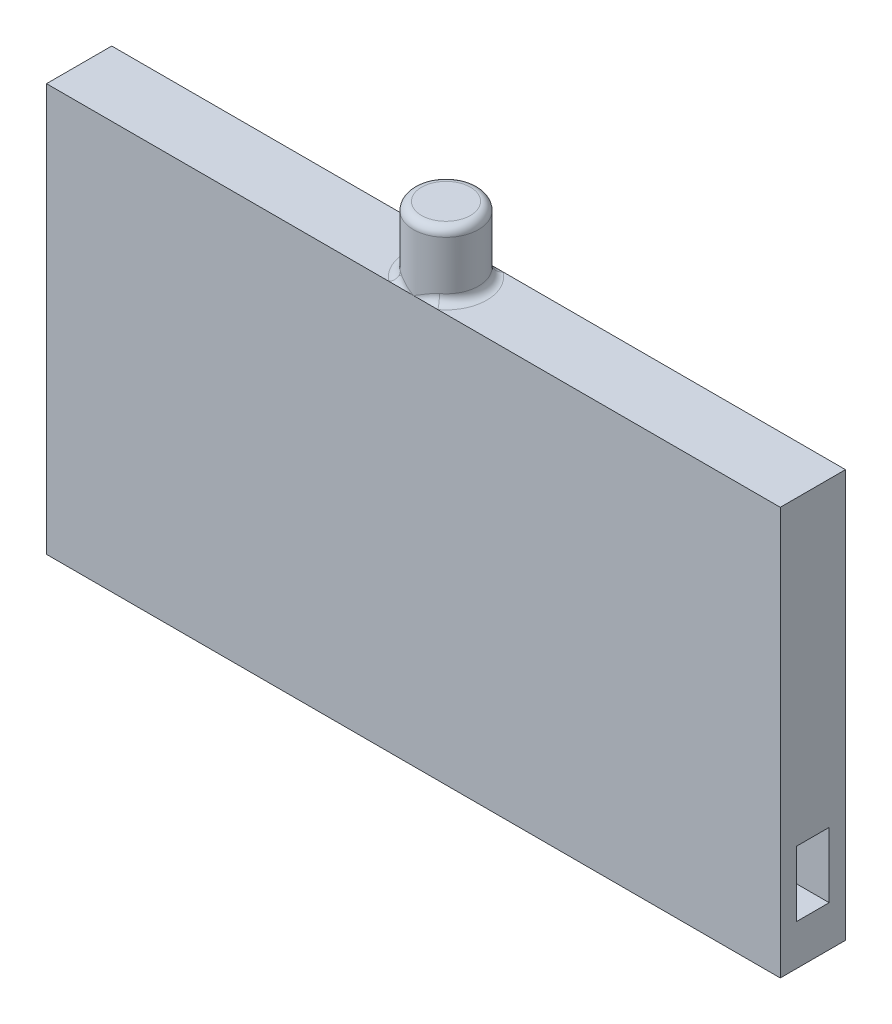
ISO-10303-21;
HEADER;
FILE_DESCRIPTION(('STEP AP214'),'2;1');
FILE_NAME('part.step','',(''),(''),'','','');
FILE_SCHEMA(('AUTOMOTIVE_DESIGN { 1 0 10303 214 1 1 1 1 }'));
ENDSEC;
DATA;
#1=APPLICATION_CONTEXT('core data for automotive mechanical design processes');
#2=APPLICATION_PROTOCOL_DEFINITION('international standard','automotive_design',2000,#1);
#3=PRODUCT_CONTEXT('',#1,'mechanical');
#4=PRODUCT('Part','Part','',(#3));
#5=PRODUCT_RELATED_PRODUCT_CATEGORY('part','',(#4));
#6=PRODUCT_DEFINITION_FORMATION('','',#4);
#7=PRODUCT_DEFINITION_CONTEXT('part definition',#1,'design');
#8=PRODUCT_DEFINITION('design','',#6,#7);
#9=PRODUCT_DEFINITION_SHAPE('','',#8);
#10=(LENGTH_UNIT() NAMED_UNIT(*) SI_UNIT(.MILLI.,.METRE.));
#11=(NAMED_UNIT(*) PLANE_ANGLE_UNIT() SI_UNIT($,.RADIAN.));
#12=(NAMED_UNIT(*) SI_UNIT($,.STERADIAN.) SOLID_ANGLE_UNIT());
#13=UNCERTAINTY_MEASURE_WITH_UNIT(LENGTH_MEASURE(1.E-05),#10,'distance_accuracy_value','');
#14=(GEOMETRIC_REPRESENTATION_CONTEXT(3) GLOBAL_UNCERTAINTY_ASSIGNED_CONTEXT((#13)) GLOBAL_UNIT_ASSIGNED_CONTEXT((#10,
#11,#12)) REPRESENTATION_CONTEXT('',''));
#15=CARTESIAN_POINT('',(0.,0.,0.));
#16=DIRECTION('',(0.,0.,1.));
#17=DIRECTION('',(1.,0.,0.));
#18=AXIS2_PLACEMENT_3D('',#15,#16,#17);
#19=CARTESIAN_POINT('',(0.,12.7,0.));
#20=DIRECTION('',(0.,-1.,0.));
#21=DIRECTION('',(0.,0.,-1.));
#22=AXIS2_PLACEMENT_3D('',#19,#20,#21);
#23=PLANE('',#22);
#24=DIRECTION('',(-1.,0.,0.));
#25=VECTOR('',#24,1.);
#26=CARTESIAN_POINT('',(-9.906,12.7,-15.7398333107177));
#27=LINE('',#26,#25);
#28=CARTESIAN_POINT('',(12.954,12.7,-15.7398333107177));
#29=VERTEX_POINT('',#28);
#30=CARTESIAN_POINT('',(2.286,12.7,-15.7398333107177));
#31=VERTEX_POINT('',#30);
#32=EDGE_CURVE('E211',#29,#31,#27,.T.);
#33=ORIENTED_EDGE('',*,*,#32,.T.);
#34=CARTESIAN_POINT('',(1.524,12.7,-14.7238333107177));
#35=DIRECTION('',(0.,-1.,0.));
#36=DIRECTION('',(0.,0.,-1.));
#37=AXIS2_PLACEMENT_3D('',#34,#35,#36);
#38=CIRCLE('',#37,1.27);
#39=CARTESIAN_POINT('',(2.286,12.7,-13.7078333107177));
#40=VERTEX_POINT('',#39);
#41=EDGE_CURVE('E11',#31,#40,#38,.T.);
#42=ORIENTED_EDGE('',*,*,#41,.T.);
#43=DIRECTION('',(1.,0.,0.));
#44=VECTOR('',#43,1.);
#45=CARTESIAN_POINT('',(-9.906,12.7,-13.7078333107177));
#46=LINE('',#45,#44);
#47=CARTESIAN_POINT('',(12.954,12.7,-13.7078333107177));
#48=VERTEX_POINT('',#47);
#49=EDGE_CURVE('E199',#40,#48,#46,.T.);
#50=ORIENTED_EDGE('',*,*,#49,.T.);
#51=DIRECTION('',(0.,0.,-1.));
#52=VECTOR('',#51,1.);
#53=CARTESIAN_POINT('',(12.954,12.7,-13.7078333107177));
#54=LINE('',#53,#52);
#55=EDGE_CURVE('E205',#48,#29,#54,.T.);
#56=ORIENTED_EDGE('',*,*,#55,.T.);
#57=EDGE_LOOP('',(#33,#42,#50,#56));
#58=FACE_BOUND('',#57,.T.);
#59=ADVANCED_FACE('F41',(#58),#23,.F.);
#60=CARTESIAN_POINT('',(-9.906,12.7,-13.7078333107177));
#61=DIRECTION('',(1.,0.,0.));
#62=DIRECTION('',(0.,0.,-1.));
#63=AXIS2_PLACEMENT_3D('',#60,#61,#62);
#64=PLANE('',#63);
#65=DIRECTION('',(0.,0.,1.));
#66=VECTOR('',#65,1.);
#67=CARTESIAN_POINT('',(-9.906,0.,-13.7078333107177));
#68=LINE('',#67,#66);
#69=CARTESIAN_POINT('',(-9.906,0.,-15.7398333107177));
#70=VERTEX_POINT('',#69);
#71=CARTESIAN_POINT('',(-9.906,0.,-13.7078333107177));
#72=VERTEX_POINT('',#71);
#73=EDGE_CURVE('E216',#70,#72,#68,.T.);
#74=ORIENTED_EDGE('',*,*,#73,.T.);
#75=DIRECTION('',(0.,-1.,0.));
#76=VECTOR('',#75,1.);
#77=CARTESIAN_POINT('',(-9.906,12.7,-13.7078333107177));
#78=LINE('',#77,#76);
#79=CARTESIAN_POINT('',(-9.906,12.7,-13.7078333107177));
#80=VERTEX_POINT('',#79);
#81=EDGE_CURVE('E240',#80,#72,#78,.T.);
#82=ORIENTED_EDGE('',*,*,#81,.F.);
#83=DIRECTION('',(0.,0.,1.));
#84=VECTOR('',#83,1.);
#85=CARTESIAN_POINT('',(-9.906,12.7,-13.7078333107177));
#86=LINE('',#85,#84);
#87=CARTESIAN_POINT('',(-9.906,12.7,-15.7398333107177));
#88=VERTEX_POINT('',#87);
#89=EDGE_CURVE('E195',#88,#80,#86,.T.);
#90=ORIENTED_EDGE('',*,*,#89,.F.);
#91=DIRECTION('',(0.,-1.,0.));
#92=VECTOR('',#91,1.);
#93=CARTESIAN_POINT('',(-9.906,12.7,-15.7398333107177));
#94=LINE('',#93,#92);
#95=EDGE_CURVE('E214',#88,#70,#94,.T.);
#96=ORIENTED_EDGE('',*,*,#95,.T.);
#97=EDGE_LOOP('',(#74,#82,#90,#96));
#98=FACE_BOUND('',#97,.T.);
#99=ADVANCED_FACE('F322',(#98),#64,.F.);
#100=CARTESIAN_POINT('',(-9.906,12.7,-13.7078333107177));
#101=DIRECTION('',(0.,0.,-1.));
#102=DIRECTION('',(-1.,0.,0.));
#103=AXIS2_PLACEMENT_3D('',#100,#101,#102);
#104=PLANE('',#103);
#105=DIRECTION('',(1.,0.,0.));
#106=VECTOR('',#105,1.);
#107=CARTESIAN_POINT('',(-9.906,0.,-13.7078333107177));
#108=LINE('',#107,#106);
#109=CARTESIAN_POINT('',(12.954,0.,-13.7078333107177));
#110=VERTEX_POINT('',#109);
#111=EDGE_CURVE('E220',#72,#110,#108,.T.);
#112=ORIENTED_EDGE('',*,*,#111,.T.);
#113=DIRECTION('',(0.,-1.,0.));
#114=VECTOR('',#113,1.);
#115=CARTESIAN_POINT('',(12.954,12.7,-13.7078333107177));
#116=LINE('',#115,#114);
#117=EDGE_CURVE('E236',#48,#110,#116,.T.);
#118=ORIENTED_EDGE('',*,*,#117,.F.);
#119=ORIENTED_EDGE('',*,*,#49,.F.);
#120=CARTESIAN_POINT('',(1.524,12.7,-13.7078333107177));
#121=VERTEX_POINT('',#120);
#122=EDGE_CURVE('E207',#121,#40,#46,.T.);
#123=ORIENTED_EDGE('',*,*,#122,.F.);
#124=CARTESIAN_POINT('',(0.762000000000002,12.7,-13.7078333107177));
#125=VERTEX_POINT('',#124);
#126=EDGE_CURVE('E206',#125,#121,#46,.T.);
#127=ORIENTED_EDGE('',*,*,#126,.F.);
#128=EDGE_CURVE('E201',#80,#125,#46,.T.);
#129=ORIENTED_EDGE('',*,*,#128,.F.);
#130=ORIENTED_EDGE('',*,*,#81,.T.);
#131=EDGE_LOOP('',(#112,#118,#119,#123,#127,#129,#130));
#132=FACE_BOUND('',#131,.T.);
#133=ADVANCED_FACE('F318',(#132),#104,.F.);
#134=CARTESIAN_POINT('',(12.954,12.7,-13.7078333107177));
#135=DIRECTION('',(-1.,0.,0.));
#136=DIRECTION('',(0.,0.,1.));
#137=AXIS2_PLACEMENT_3D('',#134,#135,#136);
#138=PLANE('',#137);
#139=DIRECTION('',(0.,0.,-1.));
#140=VECTOR('',#139,1.);
#141=CARTESIAN_POINT('',(12.954,1.27,-14.2158333107177));
#142=LINE('',#141,#140);
#143=CARTESIAN_POINT('',(12.954,1.27,-14.2158333107177));
#144=VERTEX_POINT('',#143);
#145=CARTESIAN_POINT('',(12.954,1.27,-15.2318333107177));
#146=VERTEX_POINT('',#145);
#147=EDGE_CURVE('E180',#144,#146,#142,.T.);
#148=ORIENTED_EDGE('',*,*,#147,.F.);
#149=DIRECTION('',(0.,-1.,0.));
#150=VECTOR('',#149,1.);
#151=CARTESIAN_POINT('',(12.954,1.27,-14.2158333107177));
#152=LINE('',#151,#150);
#153=CARTESIAN_POINT('',(12.954,3.302,-14.2158333107177));
#154=VERTEX_POINT('',#153);
#155=EDGE_CURVE('E63',#154,#144,#152,.T.);
#156=ORIENTED_EDGE('',*,*,#155,.F.);
#157=DIRECTION('',(0.,0.,1.));
#158=VECTOR('',#157,1.);
#159=CARTESIAN_POINT('',(12.954,3.302,-14.2158333107177));
#160=LINE('',#159,#158);
#161=CARTESIAN_POINT('',(12.954,3.302,-15.2318333107177));
#162=VERTEX_POINT('',#161);
#163=EDGE_CURVE('E167',#162,#154,#160,.T.);
#164=ORIENTED_EDGE('',*,*,#163,.F.);
#165=DIRECTION('',(0.,1.,0.));
#166=VECTOR('',#165,1.);
#167=CARTESIAN_POINT('',(12.954,1.27,-15.2318333107177));
#168=LINE('',#167,#166);
#169=EDGE_CURVE('E171',#146,#162,#168,.T.);
#170=ORIENTED_EDGE('',*,*,#169,.F.);
#171=EDGE_LOOP('',(#148,#156,#164,#170));
#172=FACE_BOUND('',#171,.T.);
#173=DIRECTION('',(0.,0.,-1.));
#174=VECTOR('',#173,1.);
#175=CARTESIAN_POINT('',(12.954,0.,-13.7078333107177));
#176=LINE('',#175,#174);
#177=CARTESIAN_POINT('',(12.954,0.,-15.7398333107177));
#178=VERTEX_POINT('',#177);
#179=EDGE_CURVE('E224',#110,#178,#176,.T.);
#180=ORIENTED_EDGE('',*,*,#179,.T.);
#181=DIRECTION('',(0.,-1.,0.));
#182=VECTOR('',#181,1.);
#183=CARTESIAN_POINT('',(12.954,12.7,-15.7398333107177));
#184=LINE('',#183,#182);
#185=EDGE_CURVE('E232',#29,#178,#184,.T.);
#186=ORIENTED_EDGE('',*,*,#185,.F.);
#187=ORIENTED_EDGE('',*,*,#55,.F.);
#188=ORIENTED_EDGE('',*,*,#117,.T.);
#189=EDGE_LOOP('',(#180,#186,#187,#188));
#190=FACE_BOUND('',#189,.T.);
#191=ADVANCED_FACE('F321',(#172,#190),#138,.F.);
#192=CARTESIAN_POINT('',(-9.906,12.7,-15.7398333107177));
#193=DIRECTION('',(0.,0.,1.));
#194=DIRECTION('',(1.,0.,0.));
#195=AXIS2_PLACEMENT_3D('',#192,#193,#194);
#196=PLANE('',#195);
#197=DIRECTION('',(-1.,0.,0.));
#198=VECTOR('',#197,1.);
#199=CARTESIAN_POINT('',(-9.906,0.,-15.7398333107177));
#200=LINE('',#199,#198);
#201=EDGE_CURVE('E200',#178,#70,#200,.T.);
#202=ORIENTED_EDGE('',*,*,#201,.T.);
#203=ORIENTED_EDGE('',*,*,#95,.F.);
#204=CARTESIAN_POINT('',(0.762000000000002,12.7,-15.7398333107177));
#205=VERTEX_POINT('',#204);
#206=EDGE_CURVE('E210',#205,#88,#27,.T.);
#207=ORIENTED_EDGE('',*,*,#206,.F.);
#208=CARTESIAN_POINT('',(1.524,12.7,-15.7398333107177));
#209=VERTEX_POINT('',#208);
#210=EDGE_CURVE('E215',#209,#205,#27,.T.);
#211=ORIENTED_EDGE('',*,*,#210,.F.);
#212=EDGE_CURVE('E71',#31,#209,#27,.T.);
#213=ORIENTED_EDGE('',*,*,#212,.F.);
#214=ORIENTED_EDGE('',*,*,#32,.F.);
#215=ORIENTED_EDGE('',*,*,#185,.T.);
#216=EDGE_LOOP('',(#202,#203,#207,#211,#213,#214,#215));
#217=FACE_BOUND('',#216,.T.);
#218=ADVANCED_FACE('F291',(#217),#196,.F.);
#219=ORIENTED_EDGE('',*,*,#128,.T.);
#220=CARTESIAN_POINT('',(1.524,12.7,-14.7238333107177));
#221=DIRECTION('',(0.,-1.,0.));
#222=DIRECTION('',(0.,0.,-1.));
#223=AXIS2_PLACEMENT_3D('',#220,#221,#222);
#224=CIRCLE('',#223,1.27);
#225=EDGE_CURVE('E55',#125,#205,#224,.T.);
#226=ORIENTED_EDGE('',*,*,#225,.T.);
#227=ORIENTED_EDGE('',*,*,#206,.T.);
#228=ORIENTED_EDGE('',*,*,#89,.T.);
#229=EDGE_LOOP('',(#219,#226,#227,#228));
#230=FACE_BOUND('',#229,.T.);
#231=ADVANCED_FACE('F288',(#230),#23,.F.);
#232=CARTESIAN_POINT('',(0.,0.,0.));
#233=DIRECTION('',(0.,-1.,0.));
#234=DIRECTION('',(0.,0.,-1.));
#235=AXIS2_PLACEMENT_3D('',#232,#233,#234);
#236=PLANE('',#235);
#237=ORIENTED_EDGE('',*,*,#73,.F.);
#238=ORIENTED_EDGE('',*,*,#201,.F.);
#239=ORIENTED_EDGE('',*,*,#179,.F.);
#240=ORIENTED_EDGE('',*,*,#111,.F.);
#241=EDGE_LOOP('',(#237,#238,#239,#240));
#242=FACE_BOUND('',#241,.T.);
#243=ADVANCED_FACE('F421',(#242),#236,.T.);
#244=CARTESIAN_POINT('',(1.524,14.732,-14.7238333107177));
#245=DIRECTION('',(0.,-1.,0.));
#246=DIRECTION('',(0.,0.,-1.));
#247=AXIS2_PLACEMENT_3D('',#244,#245,#246);
#248=CYLINDRICAL_SURFACE('',#247,1.016);
#249=CARTESIAN_POINT('',(1.524,14.478,-14.7238333107177));
#250=DIRECTION('',(0.,1.,0.));
#251=DIRECTION('',(0.,0.,1.));
#252=AXIS2_PLACEMENT_3D('',#249,#250,#251);
#253=CIRCLE('',#252,1.016);
#254=CARTESIAN_POINT('',(1.524,14.478,-13.7078333107177));
#255=VERTEX_POINT('',#254);
#256=EDGE_CURVE('E248',#255,#255,#253,.F.);
#257=ORIENTED_EDGE('',*,*,#256,.T.);
#258=EDGE_LOOP('',(#257));
#259=FACE_BOUND('',#258,.T.);
#260=CARTESIAN_POINT('',(2.22999399919304,12.9323092693618,-15.4544689744403));
#261=CARTESIAN_POINT('',(2.15762912961619,12.6047525616474,-15.5243932420477));
#262=CARTESIAN_POINT('',(2.4064924989913,12.7,-15.7398333107177));
#263=CARTESIAN_POINT('',(2.21539070176302,12.9400643662147,-15.4686076936029));
#264=CARTESIAN_POINT('',(2.16013043971291,12.6217760831303,-15.5193105706868));
#265=CARTESIAN_POINT('',(2.38823837720513,12.7,-15.7398333107177));
#266=CARTESIAN_POINT('',(2.20002251066382,12.9454546331779,-15.4825825451088));
#267=CARTESIAN_POINT('',(2.15898944492113,12.6391526553524,-15.5187327865888));
#268=CARTESIAN_POINT('',(2.36902813833045,12.7,-15.7398333107177));
#269=CARTESIAN_POINT('',(2.16829395448067,12.9523528845866,-15.5096839311462));
#270=CARTESIAN_POINT('',(2.1506264079769,12.6710582418321,-15.5237704354303));
#271=CARTESIAN_POINT('',(2.32936744310018,12.7,-15.7398333107177));
#272=CARTESIAN_POINT('',(2.15194579597119,12.9539013090713,-15.5228178720088));
#273=CARTESIAN_POINT('',(2.14378702017022,12.685768224025,-15.5289959824419));
#274=CARTESIAN_POINT('',(2.30893224496265,12.7,-15.7398333107177));
#275=CARTESIAN_POINT('',(2.10900747699933,12.9541429622308,-15.5551591211067));
#276=CARTESIAN_POINT('',(2.12080212618187,12.7179163845327,-15.5462268347036));
#277=CARTESIAN_POINT('',(2.25525934625124,12.7,-15.7398333107177));
#278=CARTESIAN_POINT('',(2.0818524305337,12.9507269739582,-15.573601893695));
#279=CARTESIAN_POINT('',(2.10163664566155,12.7335982565379,-15.5603817747969));
#280=CARTESIAN_POINT('',(2.22131553817615,12.7,-15.7398333107177));
#281=CARTESIAN_POINT('',(2.02626390275384,12.939025664532,-15.607609498478));
#282=CARTESIAN_POINT('',(2.05682597770893,12.75617974827,-15.5899736995301));
#283=CARTESIAN_POINT('',(2.15182987843322,12.7,-15.7398333107177));
#284=CARTESIAN_POINT('',(1.99782272973763,12.9307060312762,-15.6231530248784));
#285=CARTESIAN_POINT('',(2.03128975608147,12.7636517012701,-15.605494761524));
#286=CARTESIAN_POINT('',(2.11627841213767,12.7,-15.7398333107177));
#287=CARTESIAN_POINT('',(1.92328672816379,12.904866876462,-15.6594677944974));
#288=CARTESIAN_POINT('',(1.9614353813307,12.774387062972,-15.6428992688062));
#289=CARTESIAN_POINT('',(2.02310841025931,12.7,-15.7398333107177));
#290=CARTESIAN_POINT('',(1.87663894934852,12.8848140642996,-15.6779437854235));
#291=CARTESIAN_POINT('',(1.91305433596181,12.7738815954522,-15.6646704824849));
#292=CARTESIAN_POINT('',(1.96479868694514,12.7,-15.7398333107177));
#293=CARTESIAN_POINT('',(1.78258626727586,12.8402683605976,-15.7076154347474));
#294=CARTESIAN_POINT('',(1.81312650696352,12.7638351499827,-15.6996887709867));
#295=CARTESIAN_POINT('',(1.84723283436228,12.7,-15.7398333107177));
#296=CARTESIAN_POINT('',(1.73518191506025,12.8157785771441,-15.718816164421));
#297=CARTESIAN_POINT('',(1.76064846188578,12.7545968557819,-15.7137001602763));
#298=CARTESIAN_POINT('',(1.78797739389608,12.7,-15.7398333107177));
#299=CARTESIAN_POINT('',(1.63492660571583,12.7619811321778,-15.7351642232897));
#300=CARTESIAN_POINT('',(1.6495216086822,12.7311085861398,-15.733821241473));
#301=CARTESIAN_POINT('',(1.66265825706662,12.7,-15.7398333107177));
#302=CARTESIAN_POINT('',(1.58202795947278,12.7324377091468,-15.7395495368551));
#303=CARTESIAN_POINT('',(1.5893044812909,12.716222578597,-15.7394740322518));
#304=CARTESIAN_POINT('',(1.59653494933849,12.7,-15.7398333107177));
#305=CARTESIAN_POINT('',(1.52747000556191,12.7019397824138,-15.7398288607023));
#306=CARTESIAN_POINT('',(1.52790377917589,12.7009699098801,-15.7398278934925));
#307=CARTESIAN_POINT('',(1.52833750695247,12.7,-15.7398333107177));
#308=CARTESIAN_POINT('',(1.52573495587471,12.70096985959,-15.7398333042165));
#309=CARTESIAN_POINT('',(1.52595182230564,12.7004849426041,-15.7398334575026));
#310=CARTESIAN_POINT('',(1.52616869484347,12.7,-15.7398333107177));
#311=CARTESIAN_POINT('',(1.524,12.7,-15.7398333107177));
#312=CARTESIAN_POINT('',(1.524,12.7,-15.7398333107177));
#313=CARTESIAN_POINT('',(1.524,12.7,-15.7398333107177));
#314=(BOUNDED_SURFACE() B_SPLINE_SURFACE(3,2,((#260,#261,#262),(#263,#264,#265),(#266,#267,
#268),(#269,#270,#271),(#272,#273,#274),(#275,#276,#277),(#278,#279,#280),(#281,#282,#283),
(#284,#285,#286),(#287,#288,#289),(#290,#291,#292),(#293,#294,#295),(#296,#297,#298),(#299,#300,
#301),(#302,#303,#304),(#305,#306,#307),(#308,#309,#310),(#311,#312,#313)),.UNSPECIFIED.,.F.,
.F.,.F.) B_SPLINE_SURFACE_WITH_KNOTS((4,2,2,2,2,2,2,2,4),(3,3),(0.,0.0793252790118578,
0.157811952154223,0.280673172074431,0.404404464946702,0.600842987831006,0.797144434390673,
1.01412570681678,1.02125313817637),(0.,1.),
.UNSPECIFIED.) GEOMETRIC_REPRESENTATION_ITEM() RATIONAL_B_SPLINE_SURFACE(((1.,0.595490754317653,
1.),(1.,0.614138792536777,1.),(1.,0.632907033109889,1.),(1.,0.669779348387161,1.),(1.,
0.687888346908783,1.),(1.,0.73287636210131,1.),(1.,0.758925185024582,1.),(1.,0.807344062701329,
1.),(1.,0.829686758942298,1.),(1.,0.882140467793232,1.),(1.,0.909101389562458,1.),(1.,
0.952536676117571,1.),(1.,0.969018345376008,1.),(1.,0.993099717373105,1.),(1.,0.999580814566414,
1.),(1.,0.999993437605627,1.),(1.,0.999999998399152,1.),(1.,1.,1.))) REPRESENTATION_ITEM('') SURFACE());
#315=CARTESIAN_POINT('',(2.22999399919304,12.9323092693618,-15.4544689744403));
#316=CARTESIAN_POINT('',(2.21539070176302,12.9400643662147,-15.4686076936029));
#317=CARTESIAN_POINT('',(2.20002251066382,12.9454546331779,-15.4825825451088));
#318=CARTESIAN_POINT('',(2.16829395448067,12.9523528845866,-15.5096839311462));
#319=CARTESIAN_POINT('',(2.15194579597118,12.9539013090713,-15.5228178720088));
#320=CARTESIAN_POINT('',(2.10900747699933,12.9541429622308,-15.5551591211067));
#321=CARTESIAN_POINT('',(2.0818524305337,12.9507269739582,-15.573601893695));
#322=CARTESIAN_POINT('',(2.02626390275384,12.939025664532,-15.607609498478));
#323=CARTESIAN_POINT('',(1.99782272973763,12.9307060312762,-15.6231530248784));
#324=CARTESIAN_POINT('',(1.92328672816379,12.904866876462,-15.6594677944974));
#325=CARTESIAN_POINT('',(1.87663894934852,12.8848140642996,-15.6779437854235));
#326=CARTESIAN_POINT('',(1.78258626727586,12.8402683605976,-15.7076154347474));
#327=CARTESIAN_POINT('',(1.73518191506025,12.8157785771441,-15.718816164421));
#328=CARTESIAN_POINT('',(1.63492660571583,12.7619811321777,-15.7351642232897));
#329=CARTESIAN_POINT('',(1.58202795947279,12.7324377091468,-15.7395495368551));
#330=CARTESIAN_POINT('',(1.52747000556191,12.7019397824138,-15.7398288607023));
#331=CARTESIAN_POINT('',(1.5257349558747,12.70096985959,-15.7398333042165));
#332=CARTESIAN_POINT('',(1.524,12.7,-15.7398333107177));
#333=B_SPLINE_CURVE_WITH_KNOTS('',3,(#315,#316,#317,#318,#319,#320,#321,#322,#323,#324,#325,
#326,#327,#328,#329,#330,#331,#332),.UNSPECIFIED.,.F.,.F.,(4,2,2,2,2,2,2,2,4),(0.,
0.0793252790118578,0.157811952154223,0.280673172074431,0.404404464946702,0.600842987831006,
0.797144434390673,1.01412570681678,1.02125313817637),.UNSPECIFIED.);
#334=CARTESIAN_POINT('',(2.1336,12.954,-15.5366333107177));
#335=VERTEX_POINT('',#334);
#336=EDGE_CURVE('E252',#335,#209,#333,.T.);
#337=ORIENTED_EDGE('',*,*,#336,.T.);
#338=CARTESIAN_POINT('',(0.641507501008595,12.7,-15.7398333107177));
#339=CARTESIAN_POINT('',(0.890370870383829,12.6047525616473,-15.5243932420477));
#340=CARTESIAN_POINT('',(0.818006000806876,12.9323092693617,-15.4544689744402));
#341=CARTESIAN_POINT('',(0.659761622794754,12.7,-15.7398333107177));
#342=CARTESIAN_POINT('',(0.887869560287096,12.6217760831301,-15.5193105706868));
#343=CARTESIAN_POINT('',(0.832609298236888,12.9400643662146,-15.4686076936028));
#344=CARTESIAN_POINT('',(0.678971861669423,12.7,-15.7398333107177));
#345=CARTESIAN_POINT('',(0.889010555078859,12.6391526553522,-15.5187327865888));
#346=CARTESIAN_POINT('',(0.847977489336078,12.9454546331779,-15.4825825451087));
#347=CARTESIAN_POINT('',(0.718632556899669,12.7,-15.7398333107177));
#348=CARTESIAN_POINT('',(0.897373592023053,12.671058241832,-15.5237704354303));
#349=CARTESIAN_POINT('',(0.879706045519202,12.9523528845866,-15.5096839311461));
#350=CARTESIAN_POINT('',(0.739067755037179,12.7,-15.7398333107177));
#351=CARTESIAN_POINT('',(0.904212979829715,12.6857682240248,-15.5289959824419));
#352=CARTESIAN_POINT('',(0.896054204028682,12.9539013090713,-15.5228178720087));
#353=CARTESIAN_POINT('',(0.792740653748561,12.7,-15.7398333107177));
#354=CARTESIAN_POINT('',(0.927197873818024,12.7179163845326,-15.5462268347036));
#355=CARTESIAN_POINT('',(0.938992523000511,12.9541429622308,-15.5551591211065));
#356=CARTESIAN_POINT('',(0.826684461823625,12.7,-15.7398333107177));
#357=CARTESIAN_POINT('',(0.946363354338319,12.7335982565378,-15.5603817747968));
#358=CARTESIAN_POINT('',(0.966147569466119,12.9507269739582,-15.5736018936949));
#359=CARTESIAN_POINT('',(0.896170121566516,12.7,-15.7398333107177));
#360=CARTESIAN_POINT('',(0.991174022290886,12.7561797482699,-15.58997369953));
#361=CARTESIAN_POINT('',(1.02173609724594,12.939025664532,-15.6076094984778));
#362=CARTESIAN_POINT('',(0.931721587862042,12.7,-15.7398333107177));
#363=CARTESIAN_POINT('',(1.01671024391832,12.76365170127,-15.6054947615239));
#364=CARTESIAN_POINT('',(1.05017727026214,12.9307060312763,-15.6231530248783));
#365=CARTESIAN_POINT('',(1.02489158974034,12.7,-15.7398333107177));
#366=CARTESIAN_POINT('',(1.08656461866902,12.774387062972,-15.6428992688061));
#367=CARTESIAN_POINT('',(1.12471327183593,12.9048668764621,-15.6594677944973));
#368=CARTESIAN_POINT('',(1.08320131305448,12.7,-15.7398333107177));
#369=CARTESIAN_POINT('',(1.13494566403788,12.7738815954522,-15.6646704824848));
#370=CARTESIAN_POINT('',(1.17136105065118,12.8848140642998,-15.6779437854234));
#371=CARTESIAN_POINT('',(1.20076716563728,12.7,-15.7398333107177));
#372=CARTESIAN_POINT('',(1.2348734930361,12.7638351499827,-15.6996887709866));
#373=CARTESIAN_POINT('',(1.26541373272379,12.8402683605977,-15.7076154347473));
#374=CARTESIAN_POINT('',(1.26002260610345,12.7,-15.7398333107177));
#375=CARTESIAN_POINT('',(1.28735153811381,12.7545968557819,-15.7137001602762));
#376=CARTESIAN_POINT('',(1.31281808493937,12.8157785771443,-15.7188161644209));
#377=CARTESIAN_POINT('',(1.38534174293305,12.7,-15.7398333107177));
#378=CARTESIAN_POINT('',(1.39847839131749,12.7311085861399,-15.733821241473));
#379=CARTESIAN_POINT('',(1.4130733942839,12.7619811321779,-15.7351642232897));
#380=CARTESIAN_POINT('',(1.45146505066133,12.7,-15.7398333107177));
#381=CARTESIAN_POINT('',(1.45869551870895,12.7162225785971,-15.7394740322518));
#382=CARTESIAN_POINT('',(1.46597204052708,12.7324377091469,-15.7395495368551));
#383=CARTESIAN_POINT('',(1.51966249304753,12.7,-15.7398333107177));
#384=CARTESIAN_POINT('',(1.52009622082411,12.7009699098801,-15.7398278934925));
#385=CARTESIAN_POINT('',(1.52052999443809,12.7019397824138,-15.7398288607023));
#386=CARTESIAN_POINT('',(1.52183130515654,12.7,-15.7398333107177));
#387=CARTESIAN_POINT('',(1.52204817769436,12.7004849426041,-15.7398334575026));
#388=CARTESIAN_POINT('',(1.5222650441253,12.70096985959,-15.7398333042165));
#389=CARTESIAN_POINT('',(1.524,12.7,-15.7398333107177));
#390=CARTESIAN_POINT('',(1.524,12.7,-15.7398333107177));
#391=CARTESIAN_POINT('',(1.524,12.7,-15.7398333107177));
#392=(BOUNDED_SURFACE() B_SPLINE_SURFACE(3,2,((#338,#339,#340),(#341,#342,#343),(#344,#345,
#346),(#347,#348,#349),(#350,#351,#352),(#353,#354,#355),(#356,#357,#358),(#359,#360,#361),
(#362,#363,#364),(#365,#366,#367),(#368,#369,#370),(#371,#372,#373),(#374,#375,#376),(#377,#378,
#379),(#380,#381,#382),(#383,#384,#385),(#386,#387,#388),(#389,#390,#391)),.UNSPECIFIED.,.F.,
.F.,.F.) B_SPLINE_SURFACE_WITH_KNOTS((4,2,2,2,2,2,2,2,4),(3,3),(0.,0.0793252790118214,
0.157811952154154,0.280673172074297,0.404404464946499,0.600842987830704,0.797144434390273,
1.01412570681693,1.02125313817652),(0.,1.),
.UNSPECIFIED.) GEOMETRIC_REPRESENTATION_ITEM() RATIONAL_B_SPLINE_SURFACE(((1.,0.595490754317544,
1.),(1.,0.614138792536657,1.),(1.,0.63290703310976,1.),(1.,0.669779348387018,1.),(1.,
0.687888346908636,1.),(1.,0.73287636210115,1.),(1.,0.758925185024416,1.),(1.,0.807344062701154,
1.),(1.,0.82968675894212,1.),(1.,0.882140467793057,1.),(1.,0.909101389562292,1.),(1.,
0.952536676117432,1.),(1.,0.969018345375888,1.),(1.,0.993099717373071,1.),(1.,0.999580814566413,
1.),(1.,0.999993437605627,1.),(1.,0.999999998399152,1.),(1.,1.,1.))) REPRESENTATION_ITEM('') SURFACE());
#393=CARTESIAN_POINT('',(0.818006000806876,12.9323092693617,-15.4544689744402));
#394=CARTESIAN_POINT('',(0.832609298236888,12.9400643662146,-15.4686076936028));
#395=CARTESIAN_POINT('',(0.847977489336078,12.9454546331779,-15.4825825451087));
#396=CARTESIAN_POINT('',(0.879706045519202,12.9523528845866,-15.5096839311461));
#397=CARTESIAN_POINT('',(0.896054204028682,12.9539013090713,-15.5228178720087));
#398=CARTESIAN_POINT('',(0.938992523000511,12.9541429622308,-15.5551591211065));
#399=CARTESIAN_POINT('',(0.966147569466119,12.9507269739582,-15.5736018936949));
#400=CARTESIAN_POINT('',(1.02173609724594,12.939025664532,-15.6076094984778));
#401=CARTESIAN_POINT('',(1.05017727026214,12.9307060312763,-15.6231530248783));
#402=CARTESIAN_POINT('',(1.12471327183593,12.9048668764621,-15.6594677944973));
#403=CARTESIAN_POINT('',(1.17136105065118,12.8848140642998,-15.6779437854234));
#404=CARTESIAN_POINT('',(1.26541373272379,12.8402683605977,-15.7076154347473));
#405=CARTESIAN_POINT('',(1.31281808493937,12.8157785771443,-15.7188161644209));
#406=CARTESIAN_POINT('',(1.4130733942839,12.7619811321779,-15.7351642232897));
#407=CARTESIAN_POINT('',(1.46597204052708,12.7324377091469,-15.7395495368551));
#408=CARTESIAN_POINT('',(1.52052999443809,12.7019397824138,-15.7398288607023));
#409=CARTESIAN_POINT('',(1.5222650441253,12.70096985959,-15.7398333042165));
#410=CARTESIAN_POINT('',(1.524,12.7,-15.7398333107177));
#411=B_SPLINE_CURVE_WITH_KNOTS('',3,(#393,#394,#395,#396,#397,#398,#399,#400,#401,#402,#403,
#404,#405,#406,#407,#408,#409,#410),.UNSPECIFIED.,.F.,.F.,(4,2,2,2,2,2,2,2,4),(0.,
0.0793252790118214,0.157811952154154,0.280673172074297,0.404404464946499,0.600842987830704,
0.797144434390273,1.01412570681693,1.02125313817652),.UNSPECIFIED.);
#412=CARTESIAN_POINT('',(0.914400000000002,12.954,-15.5366333107177));
#413=VERTEX_POINT('',#412);
#414=EDGE_CURVE('E381',#209,#413,#411,.F.);
#415=ORIENTED_EDGE('',*,*,#414,.T.);
#416=CARTESIAN_POINT('',(1.524,12.954,-14.7238333107177));
#417=DIRECTION('',(0.,-1.,0.));
#418=DIRECTION('',(0.,0.,-1.));
#419=AXIS2_PLACEMENT_3D('',#416,#417,#418);
#420=CIRCLE('',#419,1.016);
#421=CARTESIAN_POINT('',(0.914400000000002,12.954,-13.9110333107177));
#422=VERTEX_POINT('',#421);
#423=EDGE_CURVE('E363',#413,#422,#420,.F.);
#424=ORIENTED_EDGE('',*,*,#423,.T.);
#425=CARTESIAN_POINT('',(0.818006000806964,12.9323092693618,-13.993197646995));
#426=CARTESIAN_POINT('',(0.890370870383815,12.6047525616474,-13.9232733793877));
#427=CARTESIAN_POINT('',(0.641507501008704,12.7,-13.7078333107177));
#428=CARTESIAN_POINT('',(0.832609298236986,12.9400643662147,-13.9790589278324));
#429=CARTESIAN_POINT('',(0.887869560287094,12.6217760831302,-13.9283560507486));
#430=CARTESIAN_POINT('',(0.659761622794876,12.7,-13.7078333107177));
#431=CARTESIAN_POINT('',(0.847977489336187,12.9454546331779,-13.9650840763265));
#432=CARTESIAN_POINT('',(0.889010555078872,12.6391526553524,-13.9289338348466));
#433=CARTESIAN_POINT('',(0.678971861669559,12.7,-13.7078333107177));
#434=CARTESIAN_POINT('',(0.879706045519332,12.9523528845866,-13.9379826902891));
#435=CARTESIAN_POINT('',(0.8973735920231,12.6710582418321,-13.9238961860051));
#436=CARTESIAN_POINT('',(0.718632556899832,12.7,-13.7078333107177));
#437=CARTESIAN_POINT('',(0.896054204028822,12.9539013090713,-13.9248487494266));
#438=CARTESIAN_POINT('',(0.90421297982978,12.685768224025,-13.9186706389934));
#439=CARTESIAN_POINT('',(0.739067755037355,12.7,-13.7078333107177));
#440=CARTESIAN_POINT('',(0.93899252300068,12.9541429622308,-13.8925075003287));
#441=CARTESIAN_POINT('',(0.927197873818133,12.7179163845328,-13.9014397867317));
#442=CARTESIAN_POINT('',(0.792740653748772,12.7,-13.7078333107177));
#443=CARTESIAN_POINT('',(0.966147569466305,12.9507269739582,-13.8740647277404));
#444=CARTESIAN_POINT('',(0.946363354338456,12.7335982565379,-13.8872848466385));
#445=CARTESIAN_POINT('',(0.826684461823858,12.7,-13.7078333107177));
#446=CARTESIAN_POINT('',(1.02173609724617,12.939025664532,-13.8400571229574));
#447=CARTESIAN_POINT('',(0.991174022291078,12.75617974827,-13.8576929219053));
#448=CARTESIAN_POINT('',(0.896170121566795,12.7,-13.7078333107177));
#449=CARTESIAN_POINT('',(1.05017727026238,12.9307060312762,-13.8245135965569));
#450=CARTESIAN_POINT('',(1.01671024391854,12.7636517012701,-13.8421718599114));
#451=CARTESIAN_POINT('',(0.931721587862345,12.7,-13.7078333107177));
#452=CARTESIAN_POINT('',(1.12471327183622,12.904866876462,-13.788198826938));
#453=CARTESIAN_POINT('',(1.08656461866931,12.7743870629721,-13.8047673526291));
#454=CARTESIAN_POINT('',(1.0248915897407,12.7,-13.7078333107177));
#455=CARTESIAN_POINT('',(1.1713610506515,12.8848140642996,-13.7697228360118));
#456=CARTESIAN_POINT('',(1.1349456640382,12.7738815954522,-13.7829961389504));
#457=CARTESIAN_POINT('',(1.08320131305487,12.7,-13.7078333107177));
#458=CARTESIAN_POINT('',(1.26541373272416,12.8402683605975,-13.740051186688));
#459=CARTESIAN_POINT('',(1.2348734930365,12.7638351499827,-13.7479778504487));
#460=CARTESIAN_POINT('',(1.20076716563774,12.7,-13.7078333107177));
#461=CARTESIAN_POINT('',(1.31281808493976,12.8157785771441,-13.7288504570144));
#462=CARTESIAN_POINT('',(1.28735153811424,12.7545968557819,-13.733966461159));
#463=CARTESIAN_POINT('',(1.26002260610394,12.7,-13.7078333107177));
#464=CARTESIAN_POINT('',(1.41307339428417,12.7619811321777,-13.7125023981457));
#465=CARTESIAN_POINT('',(1.39847839131781,12.7311085861398,-13.7138453799624));
#466=CARTESIAN_POINT('',(1.38534174293339,12.7,-13.7078333107177));
#467=CARTESIAN_POINT('',(1.46597204052721,12.7324377091468,-13.7081170845803));
#468=CARTESIAN_POINT('',(1.4586955187091,12.716222578597,-13.7081925891836));
#469=CARTESIAN_POINT('',(1.4514650506615,12.7,-13.7078333107177));
#470=CARTESIAN_POINT('',(1.52052999443809,12.7019397824138,-13.7078377607331));
#471=CARTESIAN_POINT('',(1.52009622082411,12.7009699098801,-13.7078387279428));
#472=CARTESIAN_POINT('',(1.51966249304753,12.7,-13.7078333107177));
#473=CARTESIAN_POINT('',(1.5222650441253,12.70096985959,-13.7078333172189));
#474=CARTESIAN_POINT('',(1.52204817769436,12.7004849426041,-13.7078331639328));
#475=CARTESIAN_POINT('',(1.52183130515654,12.7,-13.7078333107177));
#476=CARTESIAN_POINT('',(1.524,12.7,-13.7078333107177));
#477=CARTESIAN_POINT('',(1.524,12.7,-13.7078333107177));
#478=CARTESIAN_POINT('',(1.524,12.7,-13.7078333107177));
#479=(BOUNDED_SURFACE() B_SPLINE_SURFACE(3,2,((#425,#426,#427),(#428,#429,#430),(#431,#432,
#433),(#434,#435,#436),(#437,#438,#439),(#440,#441,#442),(#443,#444,#445),(#446,#447,#448),
(#449,#450,#451),(#452,#453,#454),(#455,#456,#457),(#458,#459,#460),(#461,#462,#463),(#464,#465,
#466),(#467,#468,#469),(#470,#471,#472),(#473,#474,#475),(#476,#477,#478)),.UNSPECIFIED.,.F.,
.F.,.F.) B_SPLINE_SURFACE_WITH_KNOTS((4,2,2,2,2,2,2,2,4),(3,3),(0.,0.0793252790118616,
0.15781195215423,0.28067317207444,0.404404464946713,0.600842987831021,0.797144434390689,
1.01412570681677,1.02125313817637),(0.,1.),
.UNSPECIFIED.) GEOMETRIC_REPRESENTATION_ITEM() RATIONAL_B_SPLINE_SURFACE(((1.,0.595490754317655,
1.),(1.,0.614138792536779,1.),(1.,0.632907033109892,1.),(1.,0.669779348387165,1.),(1.,
0.687888346908788,1.),(1.,0.732876362101316,1.),(1.,0.75892518502459,1.),(1.,0.807344062701337,
1.),(1.,0.829686758942304,1.),(1.,0.882140467793236,1.),(1.,0.909101389562463,1.),(1.,
0.952536676117575,1.),(1.,0.969018345376012,1.),(1.,0.993099717373106,1.),(1.,0.999580814566414,
1.),(1.,0.999993437605627,1.),(1.,0.999999998399152,1.),(1.,1.,1.))) REPRESENTATION_ITEM('') SURFACE());
#480=CARTESIAN_POINT('',(0.818006000806964,12.9323092693618,-13.993197646995));
#481=CARTESIAN_POINT('',(0.832609298236986,12.9400643662147,-13.9790589278324));
#482=CARTESIAN_POINT('',(0.847977489336187,12.9454546331779,-13.9650840763265));
#483=CARTESIAN_POINT('',(0.879706045519332,12.9523528845866,-13.9379826902891));
#484=CARTESIAN_POINT('',(0.896054204028822,12.9539013090713,-13.9248487494266));
#485=CARTESIAN_POINT('',(0.93899252300068,12.9541429622308,-13.8925075003287));
#486=CARTESIAN_POINT('',(0.966147569466305,12.9507269739582,-13.8740647277404));
#487=CARTESIAN_POINT('',(1.02173609724617,12.939025664532,-13.8400571229574));
#488=CARTESIAN_POINT('',(1.05017727026238,12.9307060312762,-13.8245135965569));
#489=CARTESIAN_POINT('',(1.12471327183622,12.904866876462,-13.788198826938));
#490=CARTESIAN_POINT('',(1.1713610506515,12.8848140642996,-13.7697228360118));
#491=CARTESIAN_POINT('',(1.26541373272416,12.8402683605975,-13.740051186688));
#492=CARTESIAN_POINT('',(1.31281808493976,12.8157785771441,-13.7288504570144));
#493=CARTESIAN_POINT('',(1.41307339428417,12.7619811321777,-13.7125023981457));
#494=CARTESIAN_POINT('',(1.46597204052721,12.7324377091468,-13.7081170845803));
#495=CARTESIAN_POINT('',(1.52052999443809,12.7019397824138,-13.7078377607331));
#496=CARTESIAN_POINT('',(1.5222650441253,12.70096985959,-13.7078333172189));
#497=CARTESIAN_POINT('',(1.524,12.7,-13.7078333107177));
#498=B_SPLINE_CURVE_WITH_KNOTS('',3,(#480,#481,#482,#483,#484,#485,#486,#487,#488,#489,#490,
#491,#492,#493,#494,#495,#496,#497),.UNSPECIFIED.,.F.,.F.,(4,2,2,2,2,2,2,2,4),(0.,
0.0793252790118616,0.15781195215423,0.28067317207444,0.404404464946713,0.600842987831021,
0.797144434390689,1.01412570681677,1.02125313817637),.UNSPECIFIED.);
#499=EDGE_CURVE('E360',#422,#121,#498,.T.);
#500=ORIENTED_EDGE('',*,*,#499,.T.);
#501=CARTESIAN_POINT('',(2.40649249899141,12.7,-13.7078333107177));
#502=CARTESIAN_POINT('',(2.15762912961617,12.6047525616473,-13.9232733793876));
#503=CARTESIAN_POINT('',(2.22999399919313,12.9323092693617,-13.9931976469951));
#504=CARTESIAN_POINT('',(2.38823837720525,12.7,-13.7078333107177));
#505=CARTESIAN_POINT('',(2.16013043971291,12.6217760831301,-13.9283560507486));
#506=CARTESIAN_POINT('',(2.21539070176311,12.9400643662146,-13.9790589278325));
#507=CARTESIAN_POINT('',(2.36902813833058,12.7,-13.7078333107177));
#508=CARTESIAN_POINT('',(2.15898944492114,12.6391526553522,-13.9289338348466));
#509=CARTESIAN_POINT('',(2.20002251066392,12.9454546331779,-13.9650840763266));
#510=CARTESIAN_POINT('',(2.32936744310033,12.7,-13.7078333107177));
#511=CARTESIAN_POINT('',(2.15062640797695,12.671058241832,-13.9238961860051));
#512=CARTESIAN_POINT('',(2.1682939544808,12.9523528845866,-13.9379826902892));
#513=CARTESIAN_POINT('',(2.30893224496282,12.7,-13.7078333107177));
#514=CARTESIAN_POINT('',(2.14378702017029,12.6857682240248,-13.9186706389935));
#515=CARTESIAN_POINT('',(2.15194579597132,12.9539013090713,-13.9248487494267));
#516=CARTESIAN_POINT('',(2.25525934625144,12.7,-13.7078333107177));
#517=CARTESIAN_POINT('',(2.12080212618198,12.7179163845326,-13.9014397867318));
#518=CARTESIAN_POINT('',(2.10900747699949,12.9541429622308,-13.8925075003288));
#519=CARTESIAN_POINT('',(2.22131553817638,12.7,-13.7078333107177));
#520=CARTESIAN_POINT('',(2.10163664566168,12.7335982565378,-13.8872848466386));
#521=CARTESIAN_POINT('',(2.08185243053389,12.9507269739582,-13.8740647277405));
#522=CARTESIAN_POINT('',(2.15182987843349,12.7,-13.7078333107177));
#523=CARTESIAN_POINT('',(2.05682597770912,12.7561797482699,-13.8576929219054));
#524=CARTESIAN_POINT('',(2.02626390275406,12.939025664532,-13.8400571229575));
#525=CARTESIAN_POINT('',(2.11627841213796,12.7,-13.7078333107177));
#526=CARTESIAN_POINT('',(2.03128975608169,12.76365170127,-13.8421718599115));
#527=CARTESIAN_POINT('',(1.99782272973787,12.9307060312763,-13.8245135965571));
#528=CARTESIAN_POINT('',(2.02310841025966,12.7,-13.7078333107177));
#529=CARTESIAN_POINT('',(1.96143538133098,12.774387062972,-13.8047673526293));
#530=CARTESIAN_POINT('',(1.92328672816407,12.9048668764621,-13.7881988269381));
#531=CARTESIAN_POINT('',(1.96479868694552,12.7,-13.7078333107177));
#532=CARTESIAN_POINT('',(1.91305433596213,12.7738815954522,-13.7829961389506));
#533=CARTESIAN_POINT('',(1.87663894934882,12.8848140642998,-13.7697228360119));
#534=CARTESIAN_POINT('',(1.84723283436272,12.7,-13.7078333107177));
#535=CARTESIAN_POINT('',(1.8131265069639,12.7638351499827,-13.7479778504488));
#536=CARTESIAN_POINT('',(1.78258626727621,12.8402683605977,-13.7400511866881));
#537=CARTESIAN_POINT('',(1.78797739389655,12.7,-13.7078333107177));
#538=CARTESIAN_POINT('',(1.76064846188619,12.7545968557819,-13.7339664611591));
#539=CARTESIAN_POINT('',(1.73518191506063,12.8157785771443,-13.7288504570145));
#540=CARTESIAN_POINT('',(1.66265825706696,12.7,-13.7078333107177));
#541=CARTESIAN_POINT('',(1.64952160868251,12.7311085861399,-13.7138453799624));
#542=CARTESIAN_POINT('',(1.63492660571611,12.7619811321779,-13.7125023981457));
#543=CARTESIAN_POINT('',(1.59653494933866,12.7,-13.7078333107177));
#544=CARTESIAN_POINT('',(1.58930448129105,12.7162225785971,-13.7081925891836));
#545=CARTESIAN_POINT('',(1.58202795947292,12.7324377091469,-13.7081170845803));
#546=CARTESIAN_POINT('',(1.52833750695247,12.7,-13.7078333107177));
#547=CARTESIAN_POINT('',(1.52790377917589,12.7009699098801,-13.7078387279428));
#548=CARTESIAN_POINT('',(1.52747000556191,12.7019397824138,-13.7078377607331));
#549=CARTESIAN_POINT('',(1.52616869484347,12.7,-13.7078333107177));
#550=CARTESIAN_POINT('',(1.52595182230564,12.7004849426041,-13.7078331639328));
#551=CARTESIAN_POINT('',(1.52573495587471,12.70096985959,-13.7078333172189));
#552=CARTESIAN_POINT('',(1.524,12.7,-13.7078333107177));
#553=CARTESIAN_POINT('',(1.524,12.7,-13.7078333107177));
#554=CARTESIAN_POINT('',(1.524,12.7,-13.7078333107177));
#555=(BOUNDED_SURFACE() B_SPLINE_SURFACE(3,2,((#501,#502,#503),(#504,#505,#506),(#507,#508,
#509),(#510,#511,#512),(#513,#514,#515),(#516,#517,#518),(#519,#520,#521),(#522,#523,#524),
(#525,#526,#527),(#528,#529,#530),(#531,#532,#533),(#534,#535,#536),(#537,#538,#539),(#540,#541,
#542),(#543,#544,#545),(#546,#547,#548),(#549,#550,#551),(#552,#553,#554)),.UNSPECIFIED.,.F.,
.F.,.F.) B_SPLINE_SURFACE_WITH_KNOTS((4,2,2,2,2,2,2,2,4),(3,3),(0.,0.0793252790118218,
0.157811952154152,0.280673172074292,0.404404464946496,0.600842987830705,0.797144434390273,
1.01412570681693,1.02125313817653),(0.,1.),
.UNSPECIFIED.) GEOMETRIC_REPRESENTATION_ITEM() RATIONAL_B_SPLINE_SURFACE(((1.,0.595490754317544,
1.),(1.,0.614138792536657,1.),(1.,0.63290703310976,1.),(1.,0.669779348387017,1.),(1.,
0.687888346908635,1.),(1.,0.732876362101147,1.),(1.,0.758925185024413,1.),(1.,0.807344062701151,
1.),(1.,0.829686758942118,1.),(1.,0.882140467793056,1.),(1.,0.909101389562292,1.),(1.,
0.952536676117432,1.),(1.,0.969018345375888,1.),(1.,0.993099717373071,1.),(1.,0.999580814566413,
1.),(1.,0.999993437605627,1.),(1.,0.999999998399152,1.),(1.,1.,1.))) REPRESENTATION_ITEM('') SURFACE());
#556=CARTESIAN_POINT('',(2.22999399919313,12.9323092693617,-13.9931976469951));
#557=CARTESIAN_POINT('',(2.21539070176311,12.9400643662146,-13.9790589278325));
#558=CARTESIAN_POINT('',(2.20002251066392,12.9454546331779,-13.9650840763266));
#559=CARTESIAN_POINT('',(2.1682939544808,12.9523528845866,-13.9379826902892));
#560=CARTESIAN_POINT('',(2.15194579597132,12.9539013090713,-13.9248487494267));
#561=CARTESIAN_POINT('',(2.10900747699949,12.9541429622308,-13.8925075003288));
#562=CARTESIAN_POINT('',(2.08185243053389,12.9507269739582,-13.8740647277405));
#563=CARTESIAN_POINT('',(2.02626390275406,12.939025664532,-13.8400571229575));
#564=CARTESIAN_POINT('',(1.99782272973787,12.9307060312763,-13.8245135965571));
#565=CARTESIAN_POINT('',(1.92328672816407,12.9048668764621,-13.7881988269381));
#566=CARTESIAN_POINT('',(1.87663894934882,12.8848140642998,-13.7697228360119));
#567=CARTESIAN_POINT('',(1.78258626727621,12.8402683605977,-13.7400511866881));
#568=CARTESIAN_POINT('',(1.73518191506063,12.8157785771443,-13.7288504570145));
#569=CARTESIAN_POINT('',(1.63492660571611,12.7619811321779,-13.7125023981457));
#570=CARTESIAN_POINT('',(1.58202795947292,12.7324377091469,-13.7081170845803));
#571=CARTESIAN_POINT('',(1.52747000556191,12.7019397824138,-13.7078377607331));
#572=CARTESIAN_POINT('',(1.52573495587471,12.70096985959,-13.7078333172189));
#573=CARTESIAN_POINT('',(1.524,12.7,-13.7078333107177));
#574=B_SPLINE_CURVE_WITH_KNOTS('',3,(#556,#557,#558,#559,#560,#561,#562,#563,#564,#565,#566,
#567,#568,#569,#570,#571,#572,#573),.UNSPECIFIED.,.F.,.F.,(4,2,2,2,2,2,2,2,4),(0.,
0.0793252790118218,0.157811952154152,0.280673172074292,0.404404464946496,0.600842987830705,
0.797144434390273,1.01412570681693,1.02125313817653),.UNSPECIFIED.);
#575=CARTESIAN_POINT('',(2.1336,12.954,-13.9110333107177));
#576=VERTEX_POINT('',#575);
#577=EDGE_CURVE('E351',#121,#576,#574,.F.);
#578=ORIENTED_EDGE('',*,*,#577,.T.);
#579=CARTESIAN_POINT('',(1.524,12.954,-14.7238333107177));
#580=DIRECTION('',(0.,-1.,0.));
#581=DIRECTION('',(0.,0.,-1.));
#582=AXIS2_PLACEMENT_3D('',#579,#580,#581);
#583=CIRCLE('',#582,1.016);
#584=EDGE_CURVE('E261',#576,#335,#583,.F.);
#585=ORIENTED_EDGE('',*,*,#584,.T.);
#586=EDGE_LOOP('',(#337,#415,#424,#500,#578,#585));
#587=FACE_BOUND('',#586,.T.);
#588=ADVANCED_FACE('F263',(#259,#587),#248,.T.);
#589=CARTESIAN_POINT('',(1.524,14.732,-14.7238333107177));
#590=DIRECTION('',(0.,1.,0.));
#591=DIRECTION('',(0.,0.,1.));
#592=AXIS2_PLACEMENT_3D('',#589,#590,#591);
#593=PLANE('',#592);
#594=CARTESIAN_POINT('',(1.524,14.732,-14.7238333107177));
#595=DIRECTION('',(0.,1.,0.));
#596=DIRECTION('',(0.,0.,1.));
#597=AXIS2_PLACEMENT_3D('',#594,#595,#596);
#598=CIRCLE('',#597,0.762);
#599=CARTESIAN_POINT('',(1.524,14.732,-13.9618333107177));
#600=VERTEX_POINT('',#599);
#601=EDGE_CURVE('E244',#600,#600,#598,.T.);
#602=ORIENTED_EDGE('',*,*,#601,.T.);
#603=EDGE_LOOP('',(#602));
#604=FACE_BOUND('',#603,.T.);
#605=ADVANCED_FACE('F476',(#604),#593,.T.);
#606=CARTESIAN_POINT('',(1.524,14.478,-14.7238333107177));
#607=DIRECTION('',(0.,1.,0.));
#608=DIRECTION('',(0.,0.,1.));
#609=AXIS2_PLACEMENT_3D('',#606,#607,#608);
#610=TOROIDAL_SURFACE('',#609,0.762,0.254);
#611=ORIENTED_EDGE('',*,*,#256,.F.);
#612=EDGE_LOOP('',(#611));
#613=FACE_BOUND('',#612,.T.);
#614=ORIENTED_EDGE('',*,*,#601,.F.);
#615=EDGE_LOOP('',(#614));
#616=FACE_BOUND('',#615,.T.);
#617=ADVANCED_FACE('F271',(#613,#616),#610,.T.);
#618=ORIENTED_EDGE('',*,*,#126,.T.);
#619=ORIENTED_EDGE('',*,*,#499,.F.);
#620=CARTESIAN_POINT('',(0.76200000000018,12.954,-13.7078333107176));
#621=DIRECTION('',(-0.800000000000105,3.15528443268148E-13,-0.59999999999986));
#622=DIRECTION('',(-0.59999999999986,0.,0.800000000000105));
#623=AXIS2_PLACEMENT_3D('',#620,#621,#622);
#624=CIRCLE('',#623,0.254);
#625=EDGE_CURVE('E221',#125,#422,#624,.F.);
#626=ORIENTED_EDGE('',*,*,#625,.F.);
#627=EDGE_LOOP('',(#618,#619,#626));
#628=FACE_BOUND('',#627,.T.);
#629=ADVANCED_FACE('F330',(#628),#479,.F.);
#630=CARTESIAN_POINT('',(1.524,12.954,-14.7238333107177));
#631=DIRECTION('',(0.,-1.,0.));
#632=DIRECTION('',(0.,0.,-1.));
#633=AXIS2_PLACEMENT_3D('',#630,#631,#632);
#634=TOROIDAL_SURFACE('',#633,1.27,0.254);
#635=ORIENTED_EDGE('',*,*,#625,.T.);
#636=ORIENTED_EDGE('',*,*,#423,.F.);
#637=CARTESIAN_POINT('',(0.762000000000002,12.954,-15.7398333107177));
#638=DIRECTION('',(-0.799999999999999,0.,0.600000000000001));
#639=DIRECTION('',(0.600000000000001,0.,0.799999999999999));
#640=AXIS2_PLACEMENT_3D('',#637,#638,#639);
#641=CIRCLE('',#640,0.254);
#642=EDGE_CURVE('E300',#205,#413,#641,.T.);
#643=ORIENTED_EDGE('',*,*,#642,.F.);
#644=ORIENTED_EDGE('',*,*,#225,.F.);
#645=EDGE_LOOP('',(#635,#636,#643,#644));
#646=FACE_BOUND('',#645,.T.);
#647=ADVANCED_FACE('F404',(#646),#634,.F.);
#648=ORIENTED_EDGE('',*,*,#414,.F.);
#649=ORIENTED_EDGE('',*,*,#210,.T.);
#650=ORIENTED_EDGE('',*,*,#642,.T.);
#651=EDGE_LOOP('',(#648,#649,#650));
#652=FACE_BOUND('',#651,.T.);
#653=ADVANCED_FACE('F282',(#652),#392,.F.);
#654=ORIENTED_EDGE('',*,*,#212,.T.);
#655=ORIENTED_EDGE('',*,*,#336,.F.);
#656=CARTESIAN_POINT('',(2.28599999999982,12.954,-15.7398333107178));
#657=DIRECTION('',(0.800000000000106,3.19626215258643E-13,0.599999999999859));
#658=DIRECTION('',(0.599999999999859,0.,-0.800000000000106));
#659=AXIS2_PLACEMENT_3D('',#656,#657,#658);
#660=CIRCLE('',#659,0.254);
#661=EDGE_CURVE('E296',#31,#335,#660,.F.);
#662=ORIENTED_EDGE('',*,*,#661,.F.);
#663=EDGE_LOOP('',(#654,#655,#662));
#664=FACE_BOUND('',#663,.T.);
#665=ADVANCED_FACE('F276',(#664),#314,.F.);
#666=CARTESIAN_POINT('',(1.524,12.954,-14.7238333107177));
#667=DIRECTION('',(0.,-1.,0.));
#668=DIRECTION('',(0.,0.,-1.));
#669=AXIS2_PLACEMENT_3D('',#666,#667,#668);
#670=TOROIDAL_SURFACE('',#669,1.27,0.254);
#671=ORIENTED_EDGE('',*,*,#661,.T.);
#672=ORIENTED_EDGE('',*,*,#584,.F.);
#673=CARTESIAN_POINT('',(2.286,12.954,-13.7078333107177));
#674=DIRECTION('',(0.800000000000001,0.,-0.599999999999999));
#675=DIRECTION('',(-0.599999999999999,0.,-0.800000000000001));
#676=AXIS2_PLACEMENT_3D('',#673,#674,#675);
#677=CIRCLE('',#676,0.254);
#678=EDGE_CURVE('E189',#40,#576,#677,.T.);
#679=ORIENTED_EDGE('',*,*,#678,.F.);
#680=ORIENTED_EDGE('',*,*,#41,.F.);
#681=EDGE_LOOP('',(#671,#672,#679,#680));
#682=FACE_BOUND('',#681,.T.);
#683=ADVANCED_FACE('F281',(#682),#670,.F.);
#684=ORIENTED_EDGE('',*,*,#577,.F.);
#685=ORIENTED_EDGE('',*,*,#122,.T.);
#686=ORIENTED_EDGE('',*,*,#678,.T.);
#687=EDGE_LOOP('',(#684,#685,#686));
#688=FACE_BOUND('',#687,.T.);
#689=ADVANCED_FACE('F315',(#688),#555,.F.);
#690=CARTESIAN_POINT('',(10.414,1.27,-14.2158333107177));
#691=DIRECTION('',(0.,0.,1.));
#692=DIRECTION('',(1.,0.,0.));
#693=AXIS2_PLACEMENT_3D('',#690,#691,#692);
#694=PLANE('',#693);
#695=ORIENTED_EDGE('',*,*,#155,.T.);
#696=DIRECTION('',(1.,0.,0.));
#697=VECTOR('',#696,1.);
#698=CARTESIAN_POINT('',(10.414,1.27,-14.2158333107177));
#699=LINE('',#698,#697);
#700=CARTESIAN_POINT('',(10.414,1.27,-14.2158333107177));
#701=VERTEX_POINT('',#700);
#702=EDGE_CURVE('E142',#701,#144,#699,.T.);
#703=ORIENTED_EDGE('',*,*,#702,.F.);
#704=DIRECTION('',(0.,-1.,0.));
#705=VECTOR('',#704,1.);
#706=CARTESIAN_POINT('',(10.414,1.27,-14.2158333107177));
#707=LINE('',#706,#705);
#708=CARTESIAN_POINT('',(10.414,3.302,-14.2158333107177));
#709=VERTEX_POINT('',#708);
#710=EDGE_CURVE('E146',#709,#701,#707,.T.);
#711=ORIENTED_EDGE('',*,*,#710,.F.);
#712=DIRECTION('',(1.,0.,0.));
#713=VECTOR('',#712,1.);
#714=CARTESIAN_POINT('',(10.414,3.302,-14.2158333107177));
#715=LINE('',#714,#713);
#716=EDGE_CURVE('E186',#709,#154,#715,.T.);
#717=ORIENTED_EDGE('',*,*,#716,.T.);
#718=EDGE_LOOP('',(#695,#703,#711,#717));
#719=FACE_BOUND('',#718,.T.);
#720=ADVANCED_FACE('F144',(#719),#694,.F.);
#721=CARTESIAN_POINT('',(10.414,3.302,-14.2158333107177));
#722=DIRECTION('',(0.,1.,0.));
#723=DIRECTION('',(0.,0.,1.));
#724=AXIS2_PLACEMENT_3D('',#721,#722,#723);
#725=PLANE('',#724);
#726=ORIENTED_EDGE('',*,*,#163,.T.);
#727=ORIENTED_EDGE('',*,*,#716,.F.);
#728=DIRECTION('',(0.,0.,1.));
#729=VECTOR('',#728,1.);
#730=CARTESIAN_POINT('',(10.414,3.302,-14.2158333107177));
#731=LINE('',#730,#729);
#732=CARTESIAN_POINT('',(10.414,3.302,-15.2318333107177));
#733=VERTEX_POINT('',#732);
#734=EDGE_CURVE('E153',#733,#709,#731,.T.);
#735=ORIENTED_EDGE('',*,*,#734,.F.);
#736=DIRECTION('',(1.,0.,0.));
#737=VECTOR('',#736,1.);
#738=CARTESIAN_POINT('',(10.414,3.302,-15.2318333107177));
#739=LINE('',#738,#737);
#740=EDGE_CURVE('E190',#733,#162,#739,.T.);
#741=ORIENTED_EDGE('',*,*,#740,.T.);
#742=EDGE_LOOP('',(#726,#727,#735,#741));
#743=FACE_BOUND('',#742,.T.);
#744=ADVANCED_FACE('F464',(#743),#725,.F.);
#745=CARTESIAN_POINT('',(10.414,1.27,-15.2318333107177));
#746=DIRECTION('',(0.,0.,-1.));
#747=DIRECTION('',(-1.,0.,0.));
#748=AXIS2_PLACEMENT_3D('',#745,#746,#747);
#749=PLANE('',#748);
#750=ORIENTED_EDGE('',*,*,#169,.T.);
#751=ORIENTED_EDGE('',*,*,#740,.F.);
#752=DIRECTION('',(0.,1.,0.));
#753=VECTOR('',#752,1.);
#754=CARTESIAN_POINT('',(10.414,1.27,-15.2318333107177));
#755=LINE('',#754,#753);
#756=CARTESIAN_POINT('',(10.414,1.27,-15.2318333107177));
#757=VERTEX_POINT('',#756);
#758=EDGE_CURVE('E162',#757,#733,#755,.T.);
#759=ORIENTED_EDGE('',*,*,#758,.F.);
#760=DIRECTION('',(1.,0.,0.));
#761=VECTOR('',#760,1.);
#762=CARTESIAN_POINT('',(10.414,1.27,-15.2318333107177));
#763=LINE('',#762,#761);
#764=EDGE_CURVE('E152',#757,#146,#763,.T.);
#765=ORIENTED_EDGE('',*,*,#764,.T.);
#766=EDGE_LOOP('',(#750,#751,#759,#765));
#767=FACE_BOUND('',#766,.T.);
#768=ADVANCED_FACE('F462',(#767),#749,.F.);
#769=CARTESIAN_POINT('',(10.414,1.27,-14.2158333107177));
#770=DIRECTION('',(0.,-1.,0.));
#771=DIRECTION('',(0.,0.,-1.));
#772=AXIS2_PLACEMENT_3D('',#769,#770,#771);
#773=PLANE('',#772);
#774=ORIENTED_EDGE('',*,*,#147,.T.);
#775=ORIENTED_EDGE('',*,*,#764,.F.);
#776=DIRECTION('',(0.,0.,-1.));
#777=VECTOR('',#776,1.);
#778=CARTESIAN_POINT('',(10.414,1.27,-14.2158333107177));
#779=LINE('',#778,#777);
#780=EDGE_CURVE('E156',#701,#757,#779,.T.);
#781=ORIENTED_EDGE('',*,*,#780,.F.);
#782=ORIENTED_EDGE('',*,*,#702,.T.);
#783=EDGE_LOOP('',(#774,#775,#781,#782));
#784=FACE_BOUND('',#783,.T.);
#785=ADVANCED_FACE('F157',(#784),#773,.F.);
#786=CARTESIAN_POINT('',(10.414,0.,0.));
#787=DIRECTION('',(-1.,0.,0.));
#788=DIRECTION('',(0.,0.,1.));
#789=AXIS2_PLACEMENT_3D('',#786,#787,#788);
#790=PLANE('',#789);
#791=ORIENTED_EDGE('',*,*,#710,.T.);
#792=ORIENTED_EDGE('',*,*,#780,.T.);
#793=ORIENTED_EDGE('',*,*,#758,.T.);
#794=ORIENTED_EDGE('',*,*,#734,.T.);
#795=EDGE_LOOP('',(#791,#792,#793,#794));
#796=FACE_BOUND('',#795,.T.);
#797=ADVANCED_FACE('F164',(#796),#790,.F.);
#798=CLOSED_SHELL('',(#59,#99,#133,#191,#218,#231,#243,#588,#605,#617,#629,#647,#653,#665,#683,
#689,#720,#744,#768,#785,#797));
#799=MANIFOLD_SOLID_BREP('B2',#798);
#800=ADVANCED_BREP_SHAPE_REPRESENTATION('',(#18,#799),#14);
#801=SHAPE_DEFINITION_REPRESENTATION(#9,#800);
ENDSEC;
END-ISO-10303-21;
